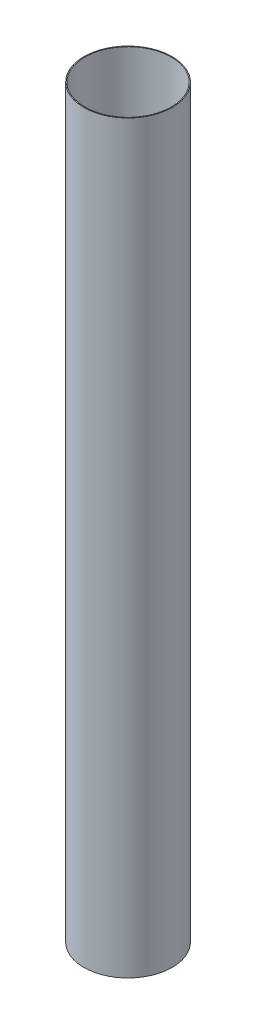
ISO-10303-21;
HEADER;
FILE_DESCRIPTION(('STEP AP214'),'2;1');
FILE_NAME('part.step','',(''),(''),'','','');
FILE_SCHEMA(('AUTOMOTIVE_DESIGN { 1 0 10303 214 1 1 1 1 }'));
ENDSEC;
DATA;
#1=APPLICATION_CONTEXT('core data for automotive mechanical design processes');
#2=APPLICATION_PROTOCOL_DEFINITION('international standard','automotive_design',2000,#1);
#3=PRODUCT_CONTEXT('',#1,'mechanical');
#4=PRODUCT('Part','Part','',(#3));
#5=PRODUCT_RELATED_PRODUCT_CATEGORY('part','',(#4));
#6=PRODUCT_DEFINITION_FORMATION('','',#4);
#7=PRODUCT_DEFINITION_CONTEXT('part definition',#1,'design');
#8=PRODUCT_DEFINITION('design','',#6,#7);
#9=PRODUCT_DEFINITION_SHAPE('','',#8);
#10=(LENGTH_UNIT() NAMED_UNIT(*) SI_UNIT(.MILLI.,.METRE.));
#11=(NAMED_UNIT(*) PLANE_ANGLE_UNIT() SI_UNIT($,.RADIAN.));
#12=(NAMED_UNIT(*) SI_UNIT($,.STERADIAN.) SOLID_ANGLE_UNIT());
#13=UNCERTAINTY_MEASURE_WITH_UNIT(LENGTH_MEASURE(1.E-05),#10,'distance_accuracy_value','');
#14=(GEOMETRIC_REPRESENTATION_CONTEXT(3) GLOBAL_UNCERTAINTY_ASSIGNED_CONTEXT((#13)) GLOBAL_UNIT_ASSIGNED_CONTEXT((#10,
#11,#12)) REPRESENTATION_CONTEXT('',''));
#15=CARTESIAN_POINT('',(0.,0.,0.));
#16=DIRECTION('',(0.,0.,1.));
#17=DIRECTION('',(1.,0.,0.));
#18=AXIS2_PLACEMENT_3D('',#15,#16,#17);
#19=CARTESIAN_POINT('',(0.,874.5982,0.));
#20=DIRECTION('',(0.,-1.,0.));
#21=DIRECTION('',(1.,0.,0.));
#22=AXIS2_PLACEMENT_3D('',#19,#20,#21);
#23=CYLINDRICAL_SURFACE('',#22,50.8);
#24=CARTESIAN_POINT('',(-9.5570773517295E-13,0.,0.));
#25=DIRECTION('',(0.,-1.,0.));
#26=DIRECTION('',(1.,0.,0.));
#27=AXIS2_PLACEMENT_3D('',#24,#25,#26);
#28=CIRCLE('',#27,50.8);
#29=CARTESIAN_POINT('',(50.799999999999,0.,0.));
#30=VERTEX_POINT('',#29);
#31=EDGE_CURVE('E19',#30,#30,#28,.T.);
#32=ORIENTED_EDGE('',*,*,#31,.T.);
#33=EDGE_LOOP('',(#32));
#34=FACE_BOUND('',#33,.T.);
#35=CARTESIAN_POINT('',(0.,874.5982,0.));
#36=DIRECTION('',(0.,-1.,0.));
#37=DIRECTION('',(1.,0.,0.));
#38=AXIS2_PLACEMENT_3D('',#35,#36,#37);
#39=CIRCLE('',#38,50.8);
#40=CARTESIAN_POINT('',(50.8,874.5982,0.));
#41=VERTEX_POINT('',#40);
#42=EDGE_CURVE('E28',#41,#41,#39,.T.);
#43=ORIENTED_EDGE('',*,*,#42,.F.);
#44=EDGE_LOOP('',(#43));
#45=FACE_BOUND('',#44,.T.);
#46=ADVANCED_FACE('F15',(#34,#45),#23,.F.);
#47=CARTESIAN_POINT('',(-52.437792,0.,-52.437792));
#48=DIRECTION('',(0.,1.,0.));
#49=DIRECTION('',(0.,0.,1.));
#50=AXIS2_PLACEMENT_3D('',#47,#48,#49);
#51=PLANE('',#50);
#52=ORIENTED_EDGE('',*,*,#31,.F.);
#53=EDGE_LOOP('',(#52));
#54=FACE_BOUND('',#53,.T.);
#55=CARTESIAN_POINT('',(-9.36968367816618E-13,0.,0.));
#56=DIRECTION('',(0.,-1.,0.));
#57=DIRECTION('',(1.,0.,0.));
#58=AXIS2_PLACEMENT_3D('',#55,#56,#57);
#59=CIRCLE('',#58,51.816);
#60=CARTESIAN_POINT('',(51.8159999999991,0.,0.));
#61=VERTEX_POINT('',#60);
#62=EDGE_CURVE('E23',#61,#61,#59,.T.);
#63=ORIENTED_EDGE('',*,*,#62,.T.);
#64=EDGE_LOOP('',(#63));
#65=FACE_BOUND('',#64,.T.);
#66=ADVANCED_FACE('F38',(#54,#65),#51,.F.);
#67=CARTESIAN_POINT('',(-52.437792,874.5982,-52.437792));
#68=DIRECTION('',(0.,1.,0.));
#69=DIRECTION('',(0.,0.,1.));
#70=AXIS2_PLACEMENT_3D('',#67,#68,#69);
#71=PLANE('',#70);
#72=ORIENTED_EDGE('',*,*,#42,.T.);
#73=EDGE_LOOP('',(#72));
#74=FACE_BOUND('',#73,.T.);
#75=CARTESIAN_POINT('',(0.,874.5982,0.));
#76=DIRECTION('',(0.,-1.,0.));
#77=DIRECTION('',(1.,0.,0.));
#78=AXIS2_PLACEMENT_3D('',#75,#76,#77);
#79=CIRCLE('',#78,51.816);
#80=CARTESIAN_POINT('',(51.816,874.5982,0.));
#81=VERTEX_POINT('',#80);
#82=EDGE_CURVE('E10',#81,#81,#79,.F.);
#83=ORIENTED_EDGE('',*,*,#82,.T.);
#84=EDGE_LOOP('',(#83));
#85=FACE_BOUND('',#84,.T.);
#86=ADVANCED_FACE('F17',(#74,#85),#71,.T.);
#87=CARTESIAN_POINT('',(0.,874.5982,0.));
#88=DIRECTION('',(0.,-1.,0.));
#89=DIRECTION('',(1.,0.,0.));
#90=AXIS2_PLACEMENT_3D('',#87,#88,#89);
#91=CYLINDRICAL_SURFACE('',#90,51.816);
#92=ORIENTED_EDGE('',*,*,#62,.F.);
#93=EDGE_LOOP('',(#92));
#94=FACE_BOUND('',#93,.T.);
#95=ORIENTED_EDGE('',*,*,#82,.F.);
#96=EDGE_LOOP('',(#95));
#97=FACE_BOUND('',#96,.T.);
#98=ADVANCED_FACE('F43',(#94,#97),#91,.T.);
#99=CLOSED_SHELL('',(#46,#66,#86,#98));
#100=MANIFOLD_SOLID_BREP('B1',#99);
#101=ADVANCED_BREP_SHAPE_REPRESENTATION('',(#18,#100),#14);
#102=SHAPE_DEFINITION_REPRESENTATION(#9,#101);
ENDSEC;
END-ISO-10303-21;
